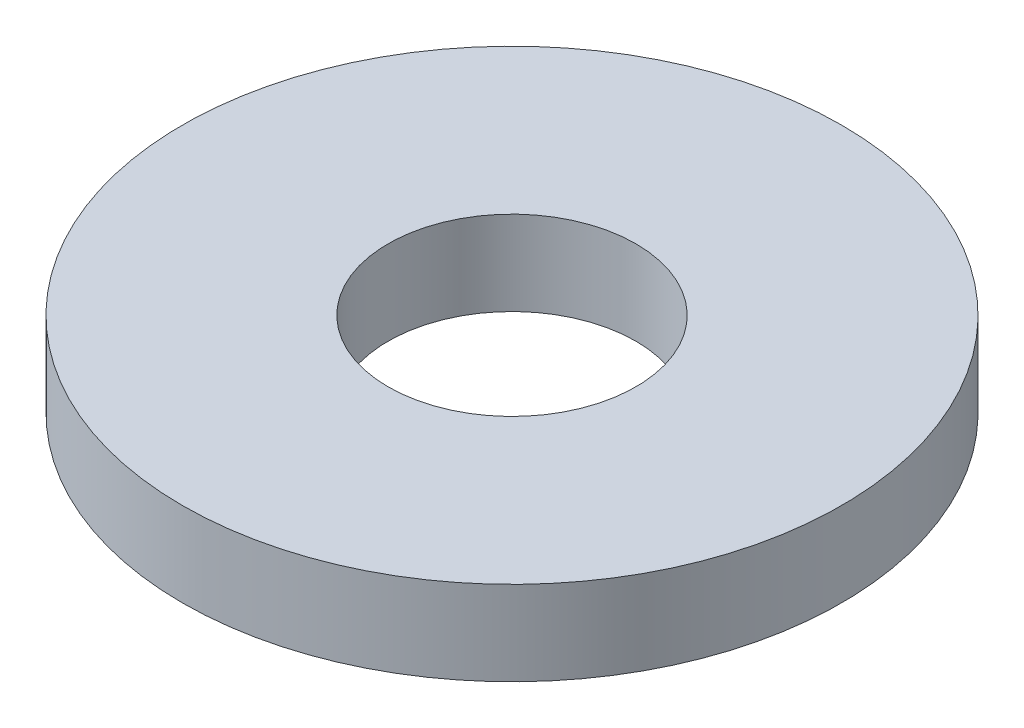
ISO-10303-21;
HEADER;
FILE_DESCRIPTION(('STEP AP214'),'2;1');
FILE_NAME('part.step','',(''),(''),'','','');
FILE_SCHEMA(('AUTOMOTIVE_DESIGN { 1 0 10303 214 1 1 1 1 }'));
ENDSEC;
DATA;
#1=APPLICATION_CONTEXT('core data for automotive mechanical design processes');
#2=APPLICATION_PROTOCOL_DEFINITION('international standard','automotive_design',2000,#1);
#3=PRODUCT_CONTEXT('',#1,'mechanical');
#4=PRODUCT('Part','Part','',(#3));
#5=PRODUCT_RELATED_PRODUCT_CATEGORY('part','',(#4));
#6=PRODUCT_DEFINITION_FORMATION('','',#4);
#7=PRODUCT_DEFINITION_CONTEXT('part definition',#1,'design');
#8=PRODUCT_DEFINITION('design','',#6,#7);
#9=PRODUCT_DEFINITION_SHAPE('','',#8);
#10=(LENGTH_UNIT() NAMED_UNIT(*) SI_UNIT(.MILLI.,.METRE.));
#11=(NAMED_UNIT(*) PLANE_ANGLE_UNIT() SI_UNIT($,.RADIAN.));
#12=(NAMED_UNIT(*) SI_UNIT($,.STERADIAN.) SOLID_ANGLE_UNIT());
#13=UNCERTAINTY_MEASURE_WITH_UNIT(LENGTH_MEASURE(1.E-05),#10,'distance_accuracy_value','');
#14=(GEOMETRIC_REPRESENTATION_CONTEXT(3) GLOBAL_UNCERTAINTY_ASSIGNED_CONTEXT((#13)) GLOBAL_UNIT_ASSIGNED_CONTEXT((#10,
#11,#12)) REPRESENTATION_CONTEXT('',''));
#15=CARTESIAN_POINT('',(0.,0.,0.));
#16=DIRECTION('',(0.,0.,1.));
#17=DIRECTION('',(1.,0.,0.));
#18=AXIS2_PLACEMENT_3D('',#15,#16,#17);
#19=CARTESIAN_POINT('',(0.,0.8128,0.));
#20=DIRECTION('',(0.,-1.,0.));
#21=DIRECTION('',(0.,0.,-1.));
#22=AXIS2_PLACEMENT_3D('',#19,#20,#21);
#23=CYLINDRICAL_SURFACE('',#22,3.175);
#24=CARTESIAN_POINT('',(0.,0.8128,0.));
#25=DIRECTION('',(0.,1.,0.));
#26=DIRECTION('',(0.,0.,1.));
#27=AXIS2_PLACEMENT_3D('',#24,#25,#26);
#28=CIRCLE('',#27,3.175);
#29=CARTESIAN_POINT('',(0.,0.8128,3.175));
#30=VERTEX_POINT('',#29);
#31=EDGE_CURVE('E10',#30,#30,#28,.T.);
#32=ORIENTED_EDGE('',*,*,#31,.F.);
#33=EDGE_LOOP('',(#32));
#34=FACE_BOUND('',#33,.T.);
#35=CARTESIAN_POINT('',(0.,0.,0.));
#36=DIRECTION('',(0.,1.,0.));
#37=DIRECTION('',(0.,0.,1.));
#38=AXIS2_PLACEMENT_3D('',#35,#36,#37);
#39=CIRCLE('',#38,3.175);
#40=CARTESIAN_POINT('',(0.,0.,3.175));
#41=VERTEX_POINT('',#40);
#42=EDGE_CURVE('E33',#41,#41,#39,.T.);
#43=ORIENTED_EDGE('',*,*,#42,.T.);
#44=EDGE_LOOP('',(#43));
#45=FACE_BOUND('',#44,.T.);
#46=ADVANCED_FACE('F30',(#34,#45),#23,.T.);
#47=CARTESIAN_POINT('',(0.,0.8128,0.));
#48=DIRECTION('',(0.,1.,0.));
#49=DIRECTION('',(0.,0.,1.));
#50=AXIS2_PLACEMENT_3D('',#47,#48,#49);
#51=PLANE('',#50);
#52=CARTESIAN_POINT('',(0.,0.8128,0.));
#53=DIRECTION('',(0.,1.,0.));
#54=DIRECTION('',(0.,0.,1.));
#55=AXIS2_PLACEMENT_3D('',#52,#53,#54);
#56=CIRCLE('',#55,1.1938);
#57=CARTESIAN_POINT('',(0.,0.8128,1.1938));
#58=VERTEX_POINT('',#57);
#59=EDGE_CURVE('E42',#58,#58,#56,.T.);
#60=ORIENTED_EDGE('',*,*,#59,.F.);
#61=EDGE_LOOP('',(#60));
#62=FACE_BOUND('',#61,.T.);
#63=ORIENTED_EDGE('',*,*,#31,.T.);
#64=EDGE_LOOP('',(#63));
#65=FACE_BOUND('',#64,.T.);
#66=ADVANCED_FACE('F57',(#62,#65),#51,.T.);
#67=CARTESIAN_POINT('',(0.,0.,0.));
#68=DIRECTION('',(0.,1.,0.));
#69=DIRECTION('',(0.,0.,1.));
#70=AXIS2_PLACEMENT_3D('',#67,#68,#69);
#71=PLANE('',#70);
#72=CARTESIAN_POINT('',(0.,0.,0.));
#73=DIRECTION('',(0.,1.,0.));
#74=DIRECTION('',(0.,0.,1.));
#75=AXIS2_PLACEMENT_3D('',#72,#73,#74);
#76=CIRCLE('',#75,1.1938);
#77=CARTESIAN_POINT('',(0.,0.,1.1938));
#78=VERTEX_POINT('',#77);
#79=EDGE_CURVE('E40',#78,#78,#76,.T.);
#80=ORIENTED_EDGE('',*,*,#79,.T.);
#81=EDGE_LOOP('',(#80));
#82=FACE_BOUND('',#81,.T.);
#83=ORIENTED_EDGE('',*,*,#42,.F.);
#84=EDGE_LOOP('',(#83));
#85=FACE_BOUND('',#84,.T.);
#86=ADVANCED_FACE('F48',(#82,#85),#71,.F.);
#87=CARTESIAN_POINT('',(0.,0.,0.));
#88=DIRECTION('',(0.,1.,0.));
#89=DIRECTION('',(0.,0.,1.));
#90=AXIS2_PLACEMENT_3D('',#87,#88,#89);
#91=CYLINDRICAL_SURFACE('',#90,1.1938);
#92=ORIENTED_EDGE('',*,*,#79,.F.);
#93=EDGE_LOOP('',(#92));
#94=FACE_BOUND('',#93,.T.);
#95=ORIENTED_EDGE('',*,*,#59,.T.);
#96=EDGE_LOOP('',(#95));
#97=FACE_BOUND('',#96,.T.);
#98=ADVANCED_FACE('F51',(#94,#97),#91,.F.);
#99=CLOSED_SHELL('',(#46,#66,#86,#98));
#100=MANIFOLD_SOLID_BREP('B2',#99);
#101=ADVANCED_BREP_SHAPE_REPRESENTATION('',(#18,#100),#14);
#102=SHAPE_DEFINITION_REPRESENTATION(#9,#101);
ENDSEC;
END-ISO-10303-21;
